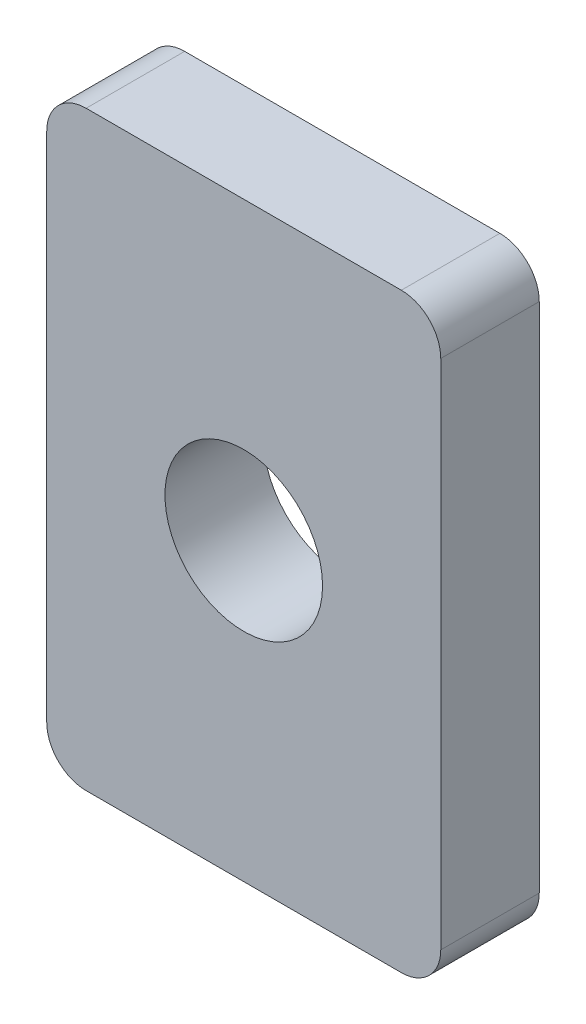
ISO-10303-21;
HEADER;
FILE_DESCRIPTION(('STEP AP214'),'2;1');
FILE_NAME('part.step','',(''),(''),'','','');
FILE_SCHEMA(('AUTOMOTIVE_DESIGN { 1 0 10303 214 1 1 1 1 }'));
ENDSEC;
DATA;
#1=APPLICATION_CONTEXT('core data for automotive mechanical design processes');
#2=APPLICATION_PROTOCOL_DEFINITION('international standard','automotive_design',2000,#1);
#3=PRODUCT_CONTEXT('',#1,'mechanical');
#4=PRODUCT('Part','Part','',(#3));
#5=PRODUCT_RELATED_PRODUCT_CATEGORY('part','',(#4));
#6=PRODUCT_DEFINITION_FORMATION('','',#4);
#7=PRODUCT_DEFINITION_CONTEXT('part definition',#1,'design');
#8=PRODUCT_DEFINITION('design','',#6,#7);
#9=PRODUCT_DEFINITION_SHAPE('','',#8);
#10=(LENGTH_UNIT() NAMED_UNIT(*) SI_UNIT(.MILLI.,.METRE.));
#11=(NAMED_UNIT(*) PLANE_ANGLE_UNIT() SI_UNIT($,.RADIAN.));
#12=(NAMED_UNIT(*) SI_UNIT($,.STERADIAN.) SOLID_ANGLE_UNIT());
#13=UNCERTAINTY_MEASURE_WITH_UNIT(LENGTH_MEASURE(1.E-05),#10,'distance_accuracy_value','');
#14=(GEOMETRIC_REPRESENTATION_CONTEXT(3) GLOBAL_UNCERTAINTY_ASSIGNED_CONTEXT((#13)) GLOBAL_UNIT_ASSIGNED_CONTEXT((#10,
#11,#12)) REPRESENTATION_CONTEXT('',''));
#15=CARTESIAN_POINT('',(0.,0.,0.));
#16=DIRECTION('',(0.,0.,1.));
#17=DIRECTION('',(1.,0.,0.));
#18=AXIS2_PLACEMENT_3D('',#15,#16,#17);
#19=CARTESIAN_POINT('',(0.,0.,2.5));
#20=DIRECTION('',(0.,0.,1.));
#21=DIRECTION('',(1.,0.,0.));
#22=AXIS2_PLACEMENT_3D('',#19,#20,#21);
#23=PLANE('',#22);
#24=DIRECTION('',(1.,0.,0.));
#25=VECTOR('',#24,1.);
#26=CARTESIAN_POINT('',(-5.,-7.5,2.5));
#27=LINE('',#26,#25);
#28=CARTESIAN_POINT('',(-4.,-7.5,2.5));
#29=VERTEX_POINT('',#28);
#30=CARTESIAN_POINT('',(4.,-7.5,2.5));
#31=VERTEX_POINT('',#30);
#32=EDGE_CURVE('E142',#29,#31,#27,.T.);
#33=ORIENTED_EDGE('',*,*,#32,.T.);
#34=CARTESIAN_POINT('',(4.,-6.5,2.5));
#35=DIRECTION('',(0.,0.,1.));
#36=DIRECTION('',(1.,0.,0.));
#37=AXIS2_PLACEMENT_3D('',#34,#35,#36);
#38=CIRCLE('',#37,1.);
#39=CARTESIAN_POINT('',(5.,-6.5,2.5));
#40=VERTEX_POINT('',#39);
#41=EDGE_CURVE('E161',#31,#40,#38,.T.);
#42=ORIENTED_EDGE('',*,*,#41,.T.);
#43=DIRECTION('',(0.,1.,0.));
#44=VECTOR('',#43,1.);
#45=CARTESIAN_POINT('',(5.,7.5,2.5));
#46=LINE('',#45,#44);
#47=CARTESIAN_POINT('',(5.,6.5,2.5));
#48=VERTEX_POINT('',#47);
#49=EDGE_CURVE('E125',#40,#48,#46,.T.);
#50=ORIENTED_EDGE('',*,*,#49,.T.);
#51=CARTESIAN_POINT('',(4.,6.5,2.5));
#52=DIRECTION('',(0.,0.,1.));
#53=DIRECTION('',(1.,0.,0.));
#54=AXIS2_PLACEMENT_3D('',#51,#52,#53);
#55=CIRCLE('',#54,1.);
#56=CARTESIAN_POINT('',(4.,7.5,2.5));
#57=VERTEX_POINT('',#56);
#58=EDGE_CURVE('E156',#48,#57,#55,.T.);
#59=ORIENTED_EDGE('',*,*,#58,.T.);
#60=DIRECTION('',(-1.,0.,0.));
#61=VECTOR('',#60,1.);
#62=CARTESIAN_POINT('',(-5.,7.5,2.5));
#63=LINE('',#62,#61);
#64=CARTESIAN_POINT('',(-4.,7.5,2.5));
#65=VERTEX_POINT('',#64);
#66=EDGE_CURVE('E172',#57,#65,#63,.T.);
#67=ORIENTED_EDGE('',*,*,#66,.T.);
#68=CARTESIAN_POINT('',(-4.,6.5,2.5));
#69=DIRECTION('',(0.,0.,1.));
#70=DIRECTION('',(1.,0.,0.));
#71=AXIS2_PLACEMENT_3D('',#68,#69,#70);
#72=CIRCLE('',#71,1.);
#73=CARTESIAN_POINT('',(-5.,6.5,2.5));
#74=VERTEX_POINT('',#73);
#75=EDGE_CURVE('E61',#65,#74,#72,.T.);
#76=ORIENTED_EDGE('',*,*,#75,.T.);
#77=DIRECTION('',(0.,-1.,0.));
#78=VECTOR('',#77,1.);
#79=CARTESIAN_POINT('',(-5.,7.5,2.5));
#80=LINE('',#79,#78);
#81=CARTESIAN_POINT('',(-5.,-6.5,2.5));
#82=VERTEX_POINT('',#81);
#83=EDGE_CURVE('E180',#74,#82,#80,.T.);
#84=ORIENTED_EDGE('',*,*,#83,.T.);
#85=CARTESIAN_POINT('',(-4.,-6.5,2.5));
#86=DIRECTION('',(0.,0.,1.));
#87=DIRECTION('',(1.,0.,0.));
#88=AXIS2_PLACEMENT_3D('',#85,#86,#87);
#89=CIRCLE('',#88,1.);
#90=EDGE_CURVE('E159',#82,#29,#89,.T.);
#91=ORIENTED_EDGE('',*,*,#90,.T.);
#92=EDGE_LOOP('',(#33,#42,#50,#59,#67,#76,#84,#91));
#93=FACE_BOUND('',#92,.T.);
#94=CARTESIAN_POINT('',(0.,0.,2.5));
#95=DIRECTION('',(0.,0.,1.));
#96=DIRECTION('',(1.,0.,0.));
#97=AXIS2_PLACEMENT_3D('',#94,#95,#96);
#98=CIRCLE('',#97,2.);
#99=CARTESIAN_POINT('',(2.,0.,2.5));
#100=VERTEX_POINT('',#99);
#101=EDGE_CURVE('E133',#100,#100,#98,.T.);
#102=ORIENTED_EDGE('',*,*,#101,.F.);
#103=EDGE_LOOP('',(#102));
#104=FACE_BOUND('',#103,.T.);
#105=ADVANCED_FACE('F39',(#93,#104),#23,.T.);
#106=CARTESIAN_POINT('',(0.,0.,0.));
#107=DIRECTION('',(0.,0.,1.));
#108=DIRECTION('',(1.,0.,0.));
#109=AXIS2_PLACEMENT_3D('',#106,#107,#108);
#110=PLANE('',#109);
#111=DIRECTION('',(0.,1.,0.));
#112=VECTOR('',#111,1.);
#113=CARTESIAN_POINT('',(5.,7.5,0.));
#114=LINE('',#113,#112);
#115=CARTESIAN_POINT('',(5.,-6.5,0.));
#116=VERTEX_POINT('',#115);
#117=CARTESIAN_POINT('',(5.,6.5,0.));
#118=VERTEX_POINT('',#117);
#119=EDGE_CURVE('E122',#116,#118,#114,.T.);
#120=ORIENTED_EDGE('',*,*,#119,.F.);
#121=CARTESIAN_POINT('',(4.,-6.5,0.));
#122=DIRECTION('',(0.,0.,1.));
#123=DIRECTION('',(1.,0.,0.));
#124=AXIS2_PLACEMENT_3D('',#121,#122,#123);
#125=CIRCLE('',#124,1.);
#126=CARTESIAN_POINT('',(4.,-7.5,0.));
#127=VERTEX_POINT('',#126);
#128=EDGE_CURVE('E105',#116,#127,#125,.F.);
#129=ORIENTED_EDGE('',*,*,#128,.T.);
#130=DIRECTION('',(1.,0.,0.));
#131=VECTOR('',#130,1.);
#132=CARTESIAN_POINT('',(-5.,-7.5,0.));
#133=LINE('',#132,#131);
#134=CARTESIAN_POINT('',(-4.,-7.5,0.));
#135=VERTEX_POINT('',#134);
#136=EDGE_CURVE('E146',#135,#127,#133,.T.);
#137=ORIENTED_EDGE('',*,*,#136,.F.);
#138=CARTESIAN_POINT('',(-4.,-6.5,0.));
#139=DIRECTION('',(0.,0.,1.));
#140=DIRECTION('',(1.,0.,0.));
#141=AXIS2_PLACEMENT_3D('',#138,#139,#140);
#142=CIRCLE('',#141,1.);
#143=CARTESIAN_POINT('',(-5.,-6.5,0.));
#144=VERTEX_POINT('',#143);
#145=EDGE_CURVE('E116',#135,#144,#142,.F.);
#146=ORIENTED_EDGE('',*,*,#145,.T.);
#147=DIRECTION('',(0.,-1.,0.));
#148=VECTOR('',#147,1.);
#149=CARTESIAN_POINT('',(-5.,7.5,0.));
#150=LINE('',#149,#148);
#151=CARTESIAN_POINT('',(-5.,6.5,0.));
#152=VERTEX_POINT('',#151);
#153=EDGE_CURVE('E136',#152,#144,#150,.T.);
#154=ORIENTED_EDGE('',*,*,#153,.F.);
#155=CARTESIAN_POINT('',(-4.,6.5,0.));
#156=DIRECTION('',(0.,0.,1.));
#157=DIRECTION('',(1.,0.,0.));
#158=AXIS2_PLACEMENT_3D('',#155,#156,#157);
#159=CIRCLE('',#158,1.);
#160=CARTESIAN_POINT('',(-4.,7.5,0.));
#161=VERTEX_POINT('',#160);
#162=EDGE_CURVE('E150',#152,#161,#159,.F.);
#163=ORIENTED_EDGE('',*,*,#162,.T.);
#164=DIRECTION('',(-1.,0.,0.));
#165=VECTOR('',#164,1.);
#166=CARTESIAN_POINT('',(-5.,7.5,0.));
#167=LINE('',#166,#165);
#168=CARTESIAN_POINT('',(4.,7.5,0.));
#169=VERTEX_POINT('',#168);
#170=EDGE_CURVE('E132',#169,#161,#167,.T.);
#171=ORIENTED_EDGE('',*,*,#170,.F.);
#172=CARTESIAN_POINT('',(4.,6.5,0.));
#173=DIRECTION('',(0.,0.,1.));
#174=DIRECTION('',(1.,0.,0.));
#175=AXIS2_PLACEMENT_3D('',#172,#173,#174);
#176=CIRCLE('',#175,1.);
#177=EDGE_CURVE('E126',#169,#118,#176,.F.);
#178=ORIENTED_EDGE('',*,*,#177,.T.);
#179=EDGE_LOOP('',(#120,#129,#137,#146,#154,#163,#171,#178));
#180=FACE_BOUND('',#179,.T.);
#181=CARTESIAN_POINT('',(0.,0.,0.));
#182=DIRECTION('',(0.,0.,1.));
#183=DIRECTION('',(1.,0.,0.));
#184=AXIS2_PLACEMENT_3D('',#181,#182,#183);
#185=CIRCLE('',#184,2.);
#186=CARTESIAN_POINT('',(2.,0.,0.));
#187=VERTEX_POINT('',#186);
#188=EDGE_CURVE('E139',#187,#187,#185,.T.);
#189=ORIENTED_EDGE('',*,*,#188,.T.);
#190=EDGE_LOOP('',(#189));
#191=FACE_BOUND('',#190,.T.);
#192=ADVANCED_FACE('F129',(#180,#191),#110,.F.);
#193=CARTESIAN_POINT('',(5.,7.5,2.5));
#194=DIRECTION('',(-1.,0.,0.));
#195=DIRECTION('',(0.,0.,1.));
#196=AXIS2_PLACEMENT_3D('',#193,#194,#195);
#197=PLANE('',#196);
#198=ORIENTED_EDGE('',*,*,#49,.F.);
#199=DIRECTION('',(0.,0.,-1.));
#200=VECTOR('',#199,1.);
#201=CARTESIAN_POINT('',(5.,-6.5,2.5));
#202=LINE('',#201,#200);
#203=EDGE_CURVE('E109',#40,#116,#202,.T.);
#204=ORIENTED_EDGE('',*,*,#203,.T.);
#205=ORIENTED_EDGE('',*,*,#119,.T.);
#206=DIRECTION('',(0.,0.,-1.));
#207=VECTOR('',#206,1.);
#208=CARTESIAN_POINT('',(5.,6.5,2.5));
#209=LINE('',#208,#207);
#210=EDGE_CURVE('E127',#118,#48,#209,.F.);
#211=ORIENTED_EDGE('',*,*,#210,.T.);
#212=EDGE_LOOP('',(#198,#204,#205,#211));
#213=FACE_BOUND('',#212,.T.);
#214=ADVANCED_FACE('F121',(#213),#197,.F.);
#215=CARTESIAN_POINT('',(-5.,7.5,2.5));
#216=DIRECTION('',(0.,-1.,0.));
#217=DIRECTION('',(0.,0.,-1.));
#218=AXIS2_PLACEMENT_3D('',#215,#216,#217);
#219=PLANE('',#218);
#220=ORIENTED_EDGE('',*,*,#170,.T.);
#221=DIRECTION('',(0.,0.,-1.));
#222=VECTOR('',#221,1.);
#223=CARTESIAN_POINT('',(-4.,7.5,2.5));
#224=LINE('',#223,#222);
#225=EDGE_CURVE('E11',#161,#65,#224,.F.);
#226=ORIENTED_EDGE('',*,*,#225,.T.);
#227=ORIENTED_EDGE('',*,*,#66,.F.);
#228=DIRECTION('',(0.,0.,-1.));
#229=VECTOR('',#228,1.);
#230=CARTESIAN_POINT('',(4.,7.5,2.5));
#231=LINE('',#230,#229);
#232=EDGE_CURVE('E47',#57,#169,#231,.T.);
#233=ORIENTED_EDGE('',*,*,#232,.T.);
#234=EDGE_LOOP('',(#220,#226,#227,#233));
#235=FACE_BOUND('',#234,.T.);
#236=ADVANCED_FACE('F170',(#235),#219,.F.);
#237=CARTESIAN_POINT('',(-5.,7.5,2.5));
#238=DIRECTION('',(1.,0.,0.));
#239=DIRECTION('',(0.,1.,0.));
#240=AXIS2_PLACEMENT_3D('',#237,#238,#239);
#241=PLANE('',#240);
#242=ORIENTED_EDGE('',*,*,#153,.T.);
#243=DIRECTION('',(0.,0.,-1.));
#244=VECTOR('',#243,1.);
#245=CARTESIAN_POINT('',(-5.,-6.5,2.5));
#246=LINE('',#245,#244);
#247=EDGE_CURVE('E54',#144,#82,#246,.F.);
#248=ORIENTED_EDGE('',*,*,#247,.T.);
#249=ORIENTED_EDGE('',*,*,#83,.F.);
#250=DIRECTION('',(0.,0.,-1.));
#251=VECTOR('',#250,1.);
#252=CARTESIAN_POINT('',(-5.,6.5,2.5));
#253=LINE('',#252,#251);
#254=EDGE_CURVE('E163',#74,#152,#253,.T.);
#255=ORIENTED_EDGE('',*,*,#254,.T.);
#256=EDGE_LOOP('',(#242,#248,#249,#255));
#257=FACE_BOUND('',#256,.T.);
#258=ADVANCED_FACE('F179',(#257),#241,.F.);
#259=CARTESIAN_POINT('',(-5.,-7.5,2.5));
#260=DIRECTION('',(0.,1.,0.));
#261=DIRECTION('',(-1.,0.,0.));
#262=AXIS2_PLACEMENT_3D('',#259,#260,#261);
#263=PLANE('',#262);
#264=ORIENTED_EDGE('',*,*,#136,.T.);
#265=DIRECTION('',(0.,0.,-1.));
#266=VECTOR('',#265,1.);
#267=CARTESIAN_POINT('',(4.,-7.5,2.5));
#268=LINE('',#267,#266);
#269=EDGE_CURVE('E110',#127,#31,#268,.F.);
#270=ORIENTED_EDGE('',*,*,#269,.T.);
#271=ORIENTED_EDGE('',*,*,#32,.F.);
#272=DIRECTION('',(0.,0.,-1.));
#273=VECTOR('',#272,1.);
#274=CARTESIAN_POINT('',(-4.,-7.5,2.5));
#275=LINE('',#274,#273);
#276=EDGE_CURVE('E115',#29,#135,#275,.T.);
#277=ORIENTED_EDGE('',*,*,#276,.T.);
#278=EDGE_LOOP('',(#264,#270,#271,#277));
#279=FACE_BOUND('',#278,.T.);
#280=ADVANCED_FACE('F191',(#279),#263,.F.);
#281=CARTESIAN_POINT('',(0.,0.,2.5));
#282=DIRECTION('',(0.,0.,-1.));
#283=DIRECTION('',(-1.,0.,0.));
#284=AXIS2_PLACEMENT_3D('',#281,#282,#283);
#285=CYLINDRICAL_SURFACE('',#284,2.);
#286=ORIENTED_EDGE('',*,*,#101,.T.);
#287=EDGE_LOOP('',(#286));
#288=FACE_BOUND('',#287,.T.);
#289=ORIENTED_EDGE('',*,*,#188,.F.);
#290=EDGE_LOOP('',(#289));
#291=FACE_BOUND('',#290,.T.);
#292=ADVANCED_FACE('F189',(#288,#291),#285,.F.);
#293=CARTESIAN_POINT('',(4.,-6.5,2.5));
#294=DIRECTION('',(0.,0.,-1.));
#295=DIRECTION('',(-1.,0.,0.));
#296=AXIS2_PLACEMENT_3D('',#293,#294,#295);
#297=CYLINDRICAL_SURFACE('',#296,1.);
#298=ORIENTED_EDGE('',*,*,#41,.F.);
#299=ORIENTED_EDGE('',*,*,#269,.F.);
#300=ORIENTED_EDGE('',*,*,#128,.F.);
#301=ORIENTED_EDGE('',*,*,#203,.F.);
#302=EDGE_LOOP('',(#298,#299,#300,#301));
#303=FACE_BOUND('',#302,.T.);
#304=ADVANCED_FACE('F108',(#303),#297,.T.);
#305=CARTESIAN_POINT('',(-4.,-6.5,2.5));
#306=DIRECTION('',(0.,0.,-1.));
#307=DIRECTION('',(-1.,0.,0.));
#308=AXIS2_PLACEMENT_3D('',#305,#306,#307);
#309=CYLINDRICAL_SURFACE('',#308,1.);
#310=ORIENTED_EDGE('',*,*,#90,.F.);
#311=ORIENTED_EDGE('',*,*,#247,.F.);
#312=ORIENTED_EDGE('',*,*,#145,.F.);
#313=ORIENTED_EDGE('',*,*,#276,.F.);
#314=EDGE_LOOP('',(#310,#311,#312,#313));
#315=FACE_BOUND('',#314,.T.);
#316=ADVANCED_FACE('F198',(#315),#309,.T.);
#317=CARTESIAN_POINT('',(-4.,6.5,2.5));
#318=DIRECTION('',(0.,0.,-1.));
#319=DIRECTION('',(-1.,0.,0.));
#320=AXIS2_PLACEMENT_3D('',#317,#318,#319);
#321=CYLINDRICAL_SURFACE('',#320,1.);
#322=ORIENTED_EDGE('',*,*,#75,.F.);
#323=ORIENTED_EDGE('',*,*,#225,.F.);
#324=ORIENTED_EDGE('',*,*,#162,.F.);
#325=ORIENTED_EDGE('',*,*,#254,.F.);
#326=EDGE_LOOP('',(#322,#323,#324,#325));
#327=FACE_BOUND('',#326,.T.);
#328=ADVANCED_FACE('F178',(#327),#321,.T.);
#329=CARTESIAN_POINT('',(4.,6.5,2.5));
#330=DIRECTION('',(0.,0.,-1.));
#331=DIRECTION('',(-1.,0.,0.));
#332=AXIS2_PLACEMENT_3D('',#329,#330,#331);
#333=CYLINDRICAL_SURFACE('',#332,1.);
#334=ORIENTED_EDGE('',*,*,#58,.F.);
#335=ORIENTED_EDGE('',*,*,#210,.F.);
#336=ORIENTED_EDGE('',*,*,#177,.F.);
#337=ORIENTED_EDGE('',*,*,#232,.F.);
#338=EDGE_LOOP('',(#334,#335,#336,#337));
#339=FACE_BOUND('',#338,.T.);
#340=ADVANCED_FACE('F41',(#339),#333,.T.);
#341=CLOSED_SHELL('',(#105,#192,#214,#236,#258,#280,#292,#304,#316,#328,#340));
#342=MANIFOLD_SOLID_BREP('B2',#341);
#343=ADVANCED_BREP_SHAPE_REPRESENTATION('',(#18,#342),#14);
#344=SHAPE_DEFINITION_REPRESENTATION(#9,#343);
ENDSEC;
END-ISO-10303-21;
